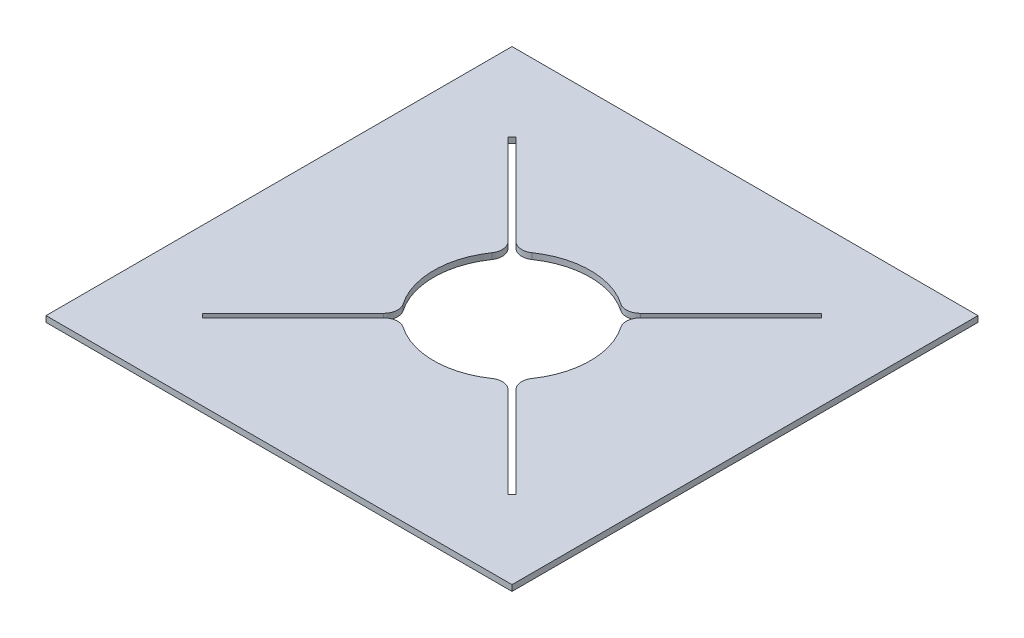
ISO-10303-21;
HEADER;
FILE_DESCRIPTION(('STEP AP214'),'2;1');
FILE_NAME('part.step','',(''),(''),'','','');
FILE_SCHEMA(('AUTOMOTIVE_DESIGN { 1 0 10303 214 1 1 1 1 }'));
ENDSEC;
DATA;
#1=APPLICATION_CONTEXT('core data for automotive mechanical design processes');
#2=APPLICATION_PROTOCOL_DEFINITION('international standard','automotive_design',2000,#1);
#3=PRODUCT_CONTEXT('',#1,'mechanical');
#4=PRODUCT('Part','Part','',(#3));
#5=PRODUCT_RELATED_PRODUCT_CATEGORY('part','',(#4));
#6=PRODUCT_DEFINITION_FORMATION('','',#4);
#7=PRODUCT_DEFINITION_CONTEXT('part definition',#1,'design');
#8=PRODUCT_DEFINITION('design','',#6,#7);
#9=PRODUCT_DEFINITION_SHAPE('','',#8);
#10=(LENGTH_UNIT() NAMED_UNIT(*) SI_UNIT(.MILLI.,.METRE.));
#11=(NAMED_UNIT(*) PLANE_ANGLE_UNIT() SI_UNIT($,.RADIAN.));
#12=(NAMED_UNIT(*) SI_UNIT($,.STERADIAN.) SOLID_ANGLE_UNIT());
#13=UNCERTAINTY_MEASURE_WITH_UNIT(LENGTH_MEASURE(1.E-05),#10,'distance_accuracy_value','');
#14=(GEOMETRIC_REPRESENTATION_CONTEXT(3) GLOBAL_UNCERTAINTY_ASSIGNED_CONTEXT((#13)) GLOBAL_UNIT_ASSIGNED_CONTEXT((#10,
#11,#12)) REPRESENTATION_CONTEXT('',''));
#15=CARTESIAN_POINT('',(0.,0.,0.));
#16=DIRECTION('',(0.,0.,1.));
#17=DIRECTION('',(1.,0.,0.));
#18=AXIS2_PLACEMENT_3D('',#15,#16,#17);
#19=CARTESIAN_POINT('',(0.,6.35,0.));
#20=DIRECTION('',(0.,1.,0.));
#21=DIRECTION('',(0.,0.,1.));
#22=AXIS2_PLACEMENT_3D('',#19,#20,#21);
#23=PLANE('',#22);
#24=DIRECTION('',(0.,0.,1.));
#25=VECTOR('',#24,1.);
#26=CARTESIAN_POINT('',(-201.962395087908,6.35,-164.543723548515));
#27=LINE('',#26,#25);
#28=CARTESIAN_POINT('',(-201.962395087908,6.35,-164.543723548515));
#29=VERTEX_POINT('',#28);
#30=CARTESIAN_POINT('',(-201.962395087908,6.35,335.456276451485));
#31=VERTEX_POINT('',#30);
#32=EDGE_CURVE('E331',#29,#31,#27,.T.);
#33=ORIENTED_EDGE('',*,*,#32,.T.);
#34=DIRECTION('',(1.,0.,0.));
#35=VECTOR('',#34,1.);
#36=CARTESIAN_POINT('',(-201.962395087908,6.35,335.456276451485));
#37=LINE('',#36,#35);
#38=CARTESIAN_POINT('',(298.037604912092,6.35,335.456276451485));
#39=VERTEX_POINT('',#38);
#40=EDGE_CURVE('E334',#31,#39,#37,.T.);
#41=ORIENTED_EDGE('',*,*,#40,.T.);
#42=DIRECTION('',(0.,0.,-1.));
#43=VECTOR('',#42,1.);
#44=CARTESIAN_POINT('',(298.037604912092,6.35,-164.543723548515));
#45=LINE('',#44,#43);
#46=CARTESIAN_POINT('',(298.037604912092,6.35,-164.543723548515));
#47=VERTEX_POINT('',#46);
#48=EDGE_CURVE('E337',#39,#47,#45,.T.);
#49=ORIENTED_EDGE('',*,*,#48,.T.);
#50=DIRECTION('',(-1.,0.,0.));
#51=VECTOR('',#50,1.);
#52=CARTESIAN_POINT('',(-201.962395087908,6.35,-164.543723548515));
#53=LINE('',#52,#51);
#54=EDGE_CURVE('E339',#47,#29,#53,.T.);
#55=ORIENTED_EDGE('',*,*,#54,.T.);
#56=EDGE_LOOP('',(#33,#41,#49,#55));
#57=FACE_BOUND('',#56,.T.);
#58=CARTESIAN_POINT('',(48.0376049120916,6.35,85.4562764514846));
#59=DIRECTION('',(0.,1.,0.));
#60=DIRECTION('',(0.,0.,1.));
#61=AXIS2_PLACEMENT_3D('',#58,#59,#60);
#62=CIRCLE('',#61,84.);
#63=CARTESIAN_POINT('',(95.6451066823906,6.35,16.2498766376597));
#64=VERTEX_POINT('',#63);
#65=CARTESIAN_POINT('',(0.430103141786861,6.35,16.2498766376637));
#66=VERTEX_POINT('',#65);
#67=EDGE_CURVE('E325',#64,#66,#62,.T.);
#68=ORIENTED_EDGE('',*,*,#67,.F.);
#69=CARTESIAN_POINT('',(104.14644628423,6.35,3.89159095661956));
#70=DIRECTION('',(0.,1.,0.));
#71=DIRECTION('',(0.,0.,1.));
#72=AXIS2_PLACEMENT_3D('',#69,#70,#71);
#73=CIRCLE('',#72,15.);
#74=CARTESIAN_POINT('',(114.753048002028,6.35,14.4981926744178));
#75=VERTEX_POINT('',#74);
#76=EDGE_CURVE('E379',#64,#75,#73,.T.);
#77=ORIENTED_EDGE('',*,*,#76,.T.);
#78=DIRECTION('',(-0.707106781186548,0.,0.707106781186546));
#79=VECTOR('',#78,1.);
#80=CARTESIAN_POINT('',(212.086378147371,6.35,-82.8351374709255));
#81=LINE('',#80,#79);
#82=CARTESIAN_POINT('',(212.086378147371,6.35,-82.8351374709255));
#83=VERTEX_POINT('',#82);
#84=EDGE_CURVE('E304',#83,#75,#81,.T.);
#85=ORIENTED_EDGE('',*,*,#84,.F.);
#86=DIRECTION('',(0.707106781186551,0.,0.707106781186544));
#87=VECTOR('',#86,1.);
#88=CARTESIAN_POINT('',(212.086378147371,6.35,-82.8351374709255));
#89=LINE('',#88,#87);
#90=CARTESIAN_POINT('',(216.329018834491,6.35,-78.5924967838062));
#91=VERTEX_POINT('',#90);
#92=EDGE_CURVE('E242',#83,#91,#89,.T.);
#93=ORIENTED_EDGE('',*,*,#92,.T.);
#94=DIRECTION('',(-0.707106781186549,0.,0.707106781186546));
#95=VECTOR('',#94,1.);
#96=CARTESIAN_POINT('',(216.329018834491,6.35,-78.5924967838062));
#97=LINE('',#96,#95);
#98=CARTESIAN_POINT('',(118.995688689149,6.35,18.740833361535));
#99=VERTEX_POINT('',#98);
#100=EDGE_CURVE('E312',#91,#99,#97,.T.);
#101=ORIENTED_EDGE('',*,*,#100,.T.);
#102=CARTESIAN_POINT('',(129.602290406947,6.35,29.3474350793332));
#103=DIRECTION('',(0.,1.,0.));
#104=DIRECTION('',(0.,0.,1.));
#105=AXIS2_PLACEMENT_3D('',#102,#103,#104);
#106=CIRCLE('',#105,15.);
#107=CARTESIAN_POINT('',(117.244004725909,6.35,37.8487746811743));
#108=VERTEX_POINT('',#107);
#109=EDGE_CURVE('E377',#99,#108,#106,.T.);
#110=ORIENTED_EDGE('',*,*,#109,.T.);
#111=CARTESIAN_POINT('',(117.244004725921,6.35,133.063778221777));
#112=VERTEX_POINT('',#111);
#113=EDGE_CURVE('E321',#112,#108,#62,.T.);
#114=ORIENTED_EDGE('',*,*,#113,.F.);
#115=CARTESIAN_POINT('',(129.602290406962,6.35,141.565117823616));
#116=DIRECTION('',(0.,1.,0.));
#117=DIRECTION('',(0.,0.,1.));
#118=AXIS2_PLACEMENT_3D('',#115,#116,#117);
#119=CIRCLE('',#118,15.);
#120=CARTESIAN_POINT('',(118.995688689163,6.35,152.171719541414));
#121=VERTEX_POINT('',#120);
#122=EDGE_CURVE('E375',#112,#121,#119,.T.);
#123=ORIENTED_EDGE('',*,*,#122,.T.);
#124=DIRECTION('',(-0.707106781186544,0.,-0.707106781186551));
#125=VECTOR('',#124,1.);
#126=CARTESIAN_POINT('',(216.329018834502,6.35,249.505049686753));
#127=LINE('',#126,#125);
#128=CARTESIAN_POINT('',(216.329018834502,6.35,249.505049686753));
#129=VERTEX_POINT('',#128);
#130=EDGE_CURVE('E286',#129,#121,#127,.T.);
#131=ORIENTED_EDGE('',*,*,#130,.F.);
#132=DIRECTION('',(-0.707106781186552,0.,0.707106781186543));
#133=VECTOR('',#132,1.);
#134=CARTESIAN_POINT('',(216.329018834502,6.35,249.505049686753));
#135=LINE('',#134,#133);
#136=CARTESIAN_POINT('',(212.086378147382,6.35,253.747690373872));
#137=VERTEX_POINT('',#136);
#138=EDGE_CURVE('E263',#129,#137,#135,.T.);
#139=ORIENTED_EDGE('',*,*,#138,.T.);
#140=DIRECTION('',(-0.707106781186544,0.,-0.707106781186551));
#141=VECTOR('',#140,1.);
#142=CARTESIAN_POINT('',(212.086378147382,6.35,253.747690373872));
#143=LINE('',#142,#141);
#144=CARTESIAN_POINT('',(114.753048002048,6.35,156.414360228537));
#145=VERTEX_POINT('',#144);
#146=EDGE_CURVE('E289',#137,#145,#143,.T.);
#147=ORIENTED_EDGE('',*,*,#146,.T.);
#148=CARTESIAN_POINT('',(104.14644628425,6.35,167.020961946336));
#149=DIRECTION('',(0.,1.,0.));
#150=DIRECTION('',(0.,0.,1.));
#151=AXIS2_PLACEMENT_3D('',#148,#149,#150);
#152=CIRCLE('',#151,15.);
#153=CARTESIAN_POINT('',(95.6451066824079,6.35,154.662676265298));
#154=VERTEX_POINT('',#153);
#155=EDGE_CURVE('E373',#145,#154,#152,.T.);
#156=ORIENTED_EDGE('',*,*,#155,.T.);
#157=CARTESIAN_POINT('',(0.430103141792704,6.35,154.662676265309));
#158=VERTEX_POINT('',#157);
#159=EDGE_CURVE('E330',#158,#154,#62,.T.);
#160=ORIENTED_EDGE('',*,*,#159,.F.);
#161=CARTESIAN_POINT('',(-8.07123646004639,6.35,167.02096194635));
#162=DIRECTION('',(0.,1.,0.));
#163=DIRECTION('',(0.,0.,1.));
#164=AXIS2_PLACEMENT_3D('',#161,#162,#163);
#165=CIRCLE('',#164,15.);
#166=CARTESIAN_POINT('',(-18.6778381778445,6.35,156.414360228551));
#167=VERTEX_POINT('',#166);
#168=EDGE_CURVE('E371',#158,#167,#165,.T.);
#169=ORIENTED_EDGE('',*,*,#168,.T.);
#170=DIRECTION('',(0.707106781186553,0.,-0.707106781186542));
#171=VECTOR('',#170,1.);
#172=CARTESIAN_POINT('',(-116.011168323177,6.35,253.747690373882));
#173=LINE('',#172,#171);
#174=CARTESIAN_POINT('',(-116.011168323177,6.35,253.747690373882));
#175=VERTEX_POINT('',#174);
#176=EDGE_CURVE('E271',#175,#167,#173,.T.);
#177=ORIENTED_EDGE('',*,*,#176,.F.);
#178=DIRECTION('',(-0.707106781186542,0.,-0.707106781186553));
#179=VECTOR('',#178,1.);
#180=CARTESIAN_POINT('',(-116.011168323177,6.35,253.747690373882));
#181=LINE('',#180,#179);
#182=CARTESIAN_POINT('',(-120.253809010296,6.35,249.505049686763));
#183=VERTEX_POINT('',#182);
#184=EDGE_CURVE('E264',#175,#183,#181,.T.);
#185=ORIENTED_EDGE('',*,*,#184,.T.);
#186=DIRECTION('',(0.707106781186554,0.,-0.707106781186541));
#187=VECTOR('',#186,1.);
#188=CARTESIAN_POINT('',(-120.253809010296,6.35,249.505049686763));
#189=LINE('',#188,#187);
#190=CARTESIAN_POINT('',(-22.9204788649661,6.35,152.171719541434));
#191=VERTEX_POINT('',#190);
#192=EDGE_CURVE('E267',#183,#191,#189,.T.);
#193=ORIENTED_EDGE('',*,*,#192,.T.);
#194=CARTESIAN_POINT('',(-33.5270805827642,6.35,141.565117823636));
#195=DIRECTION('',(0.,1.,0.));
#196=DIRECTION('',(0.,0.,1.));
#197=AXIS2_PLACEMENT_3D('',#194,#195,#196);
#198=CIRCLE('',#197,15.);
#199=CARTESIAN_POINT('',(-21.1687949017254,6.35,133.063778221795));
#200=VERTEX_POINT('',#199);
#201=EDGE_CURVE('E369',#191,#200,#198,.T.);
#202=ORIENTED_EDGE('',*,*,#201,.T.);
#203=CARTESIAN_POINT('',(-21.1687949017294,6.35,37.8487746811801));
#204=VERTEX_POINT('',#203);
#205=EDGE_CURVE('E327',#204,#200,#62,.T.);
#206=ORIENTED_EDGE('',*,*,#205,.F.);
#207=CARTESIAN_POINT('',(-33.5270805827689,6.35,29.34743507934));
#208=DIRECTION('',(0.,1.,0.));
#209=DIRECTION('',(0.,0.,1.));
#210=AXIS2_PLACEMENT_3D('',#207,#208,#209);
#211=CIRCLE('',#210,15.);
#212=CARTESIAN_POINT('',(-22.9204788649707,6.35,18.7408333615418));
#213=VERTEX_POINT('',#212);
#214=EDGE_CURVE('E247',#204,#213,#211,.T.);
#215=ORIENTED_EDGE('',*,*,#214,.T.);
#216=DIRECTION('',(0.707106781186549,0.,0.707106781186546));
#217=VECTOR('',#216,1.);
#218=CARTESIAN_POINT('',(-120.253809010307,6.35,-78.5924967837941));
#219=LINE('',#218,#217);
#220=CARTESIAN_POINT('',(-120.253809010307,6.35,-78.5924967837941));
#221=VERTEX_POINT('',#220);
#222=EDGE_CURVE('E227',#221,#213,#219,.T.);
#223=ORIENTED_EDGE('',*,*,#222,.F.);
#224=DIRECTION('',(0.707106781186543,0.,-0.707106781186552));
#225=VECTOR('',#224,1.);
#226=CARTESIAN_POINT('',(-120.253809010307,6.35,-78.5924967837941));
#227=LINE('',#226,#225);
#228=CARTESIAN_POINT('',(-116.011168323188,6.35,-82.8351374709135));
#229=VERTEX_POINT('',#228);
#230=EDGE_CURVE('E237',#221,#229,#227,.T.);
#231=ORIENTED_EDGE('',*,*,#230,.T.);
#232=DIRECTION('',(0.707106781186549,0.,0.707106781186546));
#233=VECTOR('',#232,1.);
#234=CARTESIAN_POINT('',(-116.011168323188,6.35,-82.8351374709135));
#235=LINE('',#234,#233);
#236=CARTESIAN_POINT('',(-18.6778381778515,6.35,14.4981926744224));
#237=VERTEX_POINT('',#236);
#238=EDGE_CURVE('E243',#229,#237,#235,.T.);
#239=ORIENTED_EDGE('',*,*,#238,.T.);
#240=CARTESIAN_POINT('',(-8.07123646005327,6.35,3.89159095662425));
#241=DIRECTION('',(0.,1.,0.));
#242=DIRECTION('',(0.,0.,1.));
#243=AXIS2_PLACEMENT_3D('',#240,#241,#242);
#244=CIRCLE('',#243,15.);
#245=EDGE_CURVE('E366',#237,#66,#244,.T.);
#246=ORIENTED_EDGE('',*,*,#245,.T.);
#247=EDGE_LOOP('',(#68,#77,#85,#93,#101,#110,#114,#123,#131,#139,#147,#156,#160,#169,#177,#185,
#193,#202,#206,#215,#223,#231,#239,#246));
#248=FACE_BOUND('',#247,.T.);
#249=ADVANCED_FACE('F35',(#57,#248),#23,.T.);
#250=CARTESIAN_POINT('',(0.,0.,0.));
#251=DIRECTION('',(0.,1.,0.));
#252=DIRECTION('',(0.,0.,1.));
#253=AXIS2_PLACEMENT_3D('',#250,#251,#252);
#254=PLANE('',#253);
#255=DIRECTION('',(0.,0.,1.));
#256=VECTOR('',#255,1.);
#257=CARTESIAN_POINT('',(-201.962395087908,0.,-164.543723548515));
#258=LINE('',#257,#256);
#259=CARTESIAN_POINT('',(-201.962395087908,0.,-164.543723548515));
#260=VERTEX_POINT('',#259);
#261=CARTESIAN_POINT('',(-201.962395087908,0.,335.456276451485));
#262=VERTEX_POINT('',#261);
#263=EDGE_CURVE('E342',#260,#262,#258,.T.);
#264=ORIENTED_EDGE('',*,*,#263,.F.);
#265=DIRECTION('',(-1.,0.,0.));
#266=VECTOR('',#265,1.);
#267=CARTESIAN_POINT('',(-201.962395087908,0.,-164.543723548515));
#268=LINE('',#267,#266);
#269=CARTESIAN_POINT('',(298.037604912092,0.,-164.543723548515));
#270=VERTEX_POINT('',#269);
#271=EDGE_CURVE('E335',#270,#260,#268,.T.);
#272=ORIENTED_EDGE('',*,*,#271,.F.);
#273=DIRECTION('',(0.,0.,-1.));
#274=VECTOR('',#273,1.);
#275=CARTESIAN_POINT('',(298.037604912092,0.,-164.543723548515));
#276=LINE('',#275,#274);
#277=CARTESIAN_POINT('',(298.037604912092,0.,335.456276451485));
#278=VERTEX_POINT('',#277);
#279=EDGE_CURVE('E347',#278,#270,#276,.T.);
#280=ORIENTED_EDGE('',*,*,#279,.F.);
#281=DIRECTION('',(1.,0.,0.));
#282=VECTOR('',#281,1.);
#283=CARTESIAN_POINT('',(-201.962395087908,0.,335.456276451485));
#284=LINE('',#283,#282);
#285=EDGE_CURVE('E345',#262,#278,#284,.T.);
#286=ORIENTED_EDGE('',*,*,#285,.F.);
#287=EDGE_LOOP('',(#264,#272,#280,#286));
#288=FACE_BOUND('',#287,.T.);
#289=DIRECTION('',(-0.707106781186548,0.,0.707106781186546));
#290=VECTOR('',#289,1.);
#291=CARTESIAN_POINT('',(212.086378147371,0.,-82.8351374709255));
#292=LINE('',#291,#290);
#293=CARTESIAN_POINT('',(212.086378147371,0.,-82.8351374709255));
#294=VERTEX_POINT('',#293);
#295=CARTESIAN_POINT('',(114.753048002028,0.,14.4981926744178));
#296=VERTEX_POINT('',#295);
#297=EDGE_CURVE('E306',#294,#296,#292,.T.);
#298=ORIENTED_EDGE('',*,*,#297,.T.);
#299=CARTESIAN_POINT('',(104.14644628423,0.,3.89159095661956));
#300=DIRECTION('',(0.,1.,0.));
#301=DIRECTION('',(0.,0.,1.));
#302=AXIS2_PLACEMENT_3D('',#299,#300,#301);
#303=CIRCLE('',#302,15.);
#304=CARTESIAN_POINT('',(95.6451066823906,0.,16.2498766376597));
#305=VERTEX_POINT('',#304);
#306=EDGE_CURVE('E396',#296,#305,#303,.F.);
#307=ORIENTED_EDGE('',*,*,#306,.T.);
#308=CARTESIAN_POINT('',(48.0376049120916,0.,85.4562764514846));
#309=DIRECTION('',(0.,1.,0.));
#310=DIRECTION('',(0.,0.,1.));
#311=AXIS2_PLACEMENT_3D('',#308,#309,#310);
#312=CIRCLE('',#311,84.);
#313=CARTESIAN_POINT('',(0.430103141786861,0.,16.2498766376637));
#314=VERTEX_POINT('',#313);
#315=EDGE_CURVE('E326',#305,#314,#312,.T.);
#316=ORIENTED_EDGE('',*,*,#315,.T.);
#317=CARTESIAN_POINT('',(-8.07123646005327,0.,3.89159095662425));
#318=DIRECTION('',(0.,1.,0.));
#319=DIRECTION('',(0.,0.,1.));
#320=AXIS2_PLACEMENT_3D('',#317,#318,#319);
#321=CIRCLE('',#320,15.);
#322=CARTESIAN_POINT('',(-18.6778381778515,0.,14.4981926744224));
#323=VERTEX_POINT('',#322);
#324=EDGE_CURVE('E383',#314,#323,#321,.F.);
#325=ORIENTED_EDGE('',*,*,#324,.T.);
#326=DIRECTION('',(0.707106781186549,0.,0.707106781186546));
#327=VECTOR('',#326,1.);
#328=CARTESIAN_POINT('',(-116.011168323188,0.,-82.8351374709135));
#329=LINE('',#328,#327);
#330=CARTESIAN_POINT('',(-116.011168323188,0.,-82.8351374709135));
#331=VERTEX_POINT('',#330);
#332=EDGE_CURVE('E251',#331,#323,#329,.T.);
#333=ORIENTED_EDGE('',*,*,#332,.F.);
#334=DIRECTION('',(0.707106781186543,0.,-0.707106781186552));
#335=VECTOR('',#334,1.);
#336=CARTESIAN_POINT('',(-120.253809010307,0.,-78.5924967837941));
#337=LINE('',#336,#335);
#338=CARTESIAN_POINT('',(-120.253809010307,0.,-78.5924967837941));
#339=VERTEX_POINT('',#338);
#340=EDGE_CURVE('E248',#339,#331,#337,.T.);
#341=ORIENTED_EDGE('',*,*,#340,.F.);
#342=DIRECTION('',(0.707106781186549,0.,0.707106781186546));
#343=VECTOR('',#342,1.);
#344=CARTESIAN_POINT('',(-120.253809010307,0.,-78.5924967837941));
#345=LINE('',#344,#343);
#346=CARTESIAN_POINT('',(-22.9204788649707,0.,18.7408333615418));
#347=VERTEX_POINT('',#346);
#348=EDGE_CURVE('E230',#339,#347,#345,.T.);
#349=ORIENTED_EDGE('',*,*,#348,.T.);
#350=CARTESIAN_POINT('',(-33.5270805827689,0.,29.34743507934));
#351=DIRECTION('',(0.,1.,0.));
#352=DIRECTION('',(0.,0.,1.));
#353=AXIS2_PLACEMENT_3D('',#350,#351,#352);
#354=CIRCLE('',#353,15.);
#355=CARTESIAN_POINT('',(-21.1687949017294,0.,37.8487746811801));
#356=VERTEX_POINT('',#355);
#357=EDGE_CURVE('E385',#347,#356,#354,.F.);
#358=ORIENTED_EDGE('',*,*,#357,.T.);
#359=CARTESIAN_POINT('',(-21.1687949017254,0.,133.063778221795));
#360=VERTEX_POINT('',#359);
#361=EDGE_CURVE('E435',#356,#360,#312,.T.);
#362=ORIENTED_EDGE('',*,*,#361,.T.);
#363=CARTESIAN_POINT('',(-33.5270805827642,0.,141.565117823636));
#364=DIRECTION('',(0.,1.,0.));
#365=DIRECTION('',(0.,0.,1.));
#366=AXIS2_PLACEMENT_3D('',#363,#364,#365);
#367=CIRCLE('',#366,15.);
#368=CARTESIAN_POINT('',(-22.9204788649661,0.,152.171719541434));
#369=VERTEX_POINT('',#368);
#370=EDGE_CURVE('E387',#360,#369,#367,.F.);
#371=ORIENTED_EDGE('',*,*,#370,.T.);
#372=DIRECTION('',(0.707106781186554,0.,-0.707106781186541));
#373=VECTOR('',#372,1.);
#374=CARTESIAN_POINT('',(-120.253809010296,0.,249.505049686763));
#375=LINE('',#374,#373);
#376=CARTESIAN_POINT('',(-120.253809010296,0.,249.505049686763));
#377=VERTEX_POINT('',#376);
#378=EDGE_CURVE('E275',#377,#369,#375,.T.);
#379=ORIENTED_EDGE('',*,*,#378,.F.);
#380=DIRECTION('',(-0.707106781186542,0.,-0.707106781186553));
#381=VECTOR('',#380,1.);
#382=CARTESIAN_POINT('',(-116.011168323177,0.,253.747690373882));
#383=LINE('',#382,#381);
#384=CARTESIAN_POINT('',(-116.011168323177,0.,253.747690373882));
#385=VERTEX_POINT('',#384);
#386=EDGE_CURVE('E260',#385,#377,#383,.T.);
#387=ORIENTED_EDGE('',*,*,#386,.F.);
#388=DIRECTION('',(0.707106781186553,0.,-0.707106781186542));
#389=VECTOR('',#388,1.);
#390=CARTESIAN_POINT('',(-116.011168323177,0.,253.747690373882));
#391=LINE('',#390,#389);
#392=CARTESIAN_POINT('',(-18.6778381778445,0.,156.414360228551));
#393=VERTEX_POINT('',#392);
#394=EDGE_CURVE('E268',#385,#393,#391,.T.);
#395=ORIENTED_EDGE('',*,*,#394,.T.);
#396=CARTESIAN_POINT('',(-8.07123646004639,0.,167.02096194635));
#397=DIRECTION('',(0.,1.,0.));
#398=DIRECTION('',(0.,0.,1.));
#399=AXIS2_PLACEMENT_3D('',#396,#397,#398);
#400=CIRCLE('',#399,15.);
#401=CARTESIAN_POINT('',(0.430103141792704,0.,154.662676265309));
#402=VERTEX_POINT('',#401);
#403=EDGE_CURVE('E389',#393,#402,#400,.F.);
#404=ORIENTED_EDGE('',*,*,#403,.T.);
#405=CARTESIAN_POINT('',(95.6451066824079,0.,154.662676265298));
#406=VERTEX_POINT('',#405);
#407=EDGE_CURVE('E324',#402,#406,#312,.T.);
#408=ORIENTED_EDGE('',*,*,#407,.T.);
#409=CARTESIAN_POINT('',(104.14644628425,0.,167.020961946336));
#410=DIRECTION('',(0.,1.,0.));
#411=DIRECTION('',(0.,0.,1.));
#412=AXIS2_PLACEMENT_3D('',#409,#410,#411);
#413=CIRCLE('',#412,15.);
#414=CARTESIAN_POINT('',(114.753048002048,0.,156.414360228537));
#415=VERTEX_POINT('',#414);
#416=EDGE_CURVE('E391',#406,#415,#413,.F.);
#417=ORIENTED_EDGE('',*,*,#416,.T.);
#418=DIRECTION('',(-0.707106781186544,0.,-0.707106781186551));
#419=VECTOR('',#418,1.);
#420=CARTESIAN_POINT('',(212.086378147382,0.,253.747690373872));
#421=LINE('',#420,#419);
#422=CARTESIAN_POINT('',(212.086378147382,0.,253.747690373872));
#423=VERTEX_POINT('',#422);
#424=EDGE_CURVE('E297',#423,#415,#421,.T.);
#425=ORIENTED_EDGE('',*,*,#424,.F.);
#426=DIRECTION('',(-0.707106781186552,0.,0.707106781186543));
#427=VECTOR('',#426,1.);
#428=CARTESIAN_POINT('',(216.329018834502,0.,249.505049686753));
#429=LINE('',#428,#427);
#430=CARTESIAN_POINT('',(216.329018834502,0.,249.505049686753));
#431=VERTEX_POINT('',#430);
#432=EDGE_CURVE('E290',#431,#423,#429,.T.);
#433=ORIENTED_EDGE('',*,*,#432,.F.);
#434=DIRECTION('',(-0.707106781186544,0.,-0.707106781186551));
#435=VECTOR('',#434,1.);
#436=CARTESIAN_POINT('',(216.329018834502,0.,249.505049686753));
#437=LINE('',#436,#435);
#438=CARTESIAN_POINT('',(118.995688689163,0.,152.171719541414));
#439=VERTEX_POINT('',#438);
#440=EDGE_CURVE('E285',#431,#439,#437,.T.);
#441=ORIENTED_EDGE('',*,*,#440,.T.);
#442=CARTESIAN_POINT('',(129.602290406962,0.,141.565117823616));
#443=DIRECTION('',(0.,1.,0.));
#444=DIRECTION('',(0.,0.,1.));
#445=AXIS2_PLACEMENT_3D('',#442,#443,#444);
#446=CIRCLE('',#445,15.);
#447=CARTESIAN_POINT('',(117.244004725921,0.,133.063778221777));
#448=VERTEX_POINT('',#447);
#449=EDGE_CURVE('E393',#439,#448,#446,.F.);
#450=ORIENTED_EDGE('',*,*,#449,.T.);
#451=CARTESIAN_POINT('',(117.244004725909,0.,37.8487746811743));
#452=VERTEX_POINT('',#451);
#453=EDGE_CURVE('E322',#448,#452,#312,.T.);
#454=ORIENTED_EDGE('',*,*,#453,.T.);
#455=CARTESIAN_POINT('',(129.602290406947,0.,29.3474350793332));
#456=DIRECTION('',(0.,1.,0.));
#457=DIRECTION('',(0.,0.,1.));
#458=AXIS2_PLACEMENT_3D('',#455,#456,#457);
#459=CIRCLE('',#458,15.);
#460=CARTESIAN_POINT('',(118.995688689149,0.,18.740833361535));
#461=VERTEX_POINT('',#460);
#462=EDGE_CURVE('E50',#452,#461,#459,.F.);
#463=ORIENTED_EDGE('',*,*,#462,.T.);
#464=DIRECTION('',(-0.707106781186549,0.,0.707106781186546));
#465=VECTOR('',#464,1.);
#466=CARTESIAN_POINT('',(216.329018834491,0.,-78.5924967838062));
#467=LINE('',#466,#465);
#468=CARTESIAN_POINT('',(216.329018834491,0.,-78.5924967838062));
#469=VERTEX_POINT('',#468);
#470=EDGE_CURVE('E303',#469,#461,#467,.T.);
#471=ORIENTED_EDGE('',*,*,#470,.F.);
#472=DIRECTION('',(0.707106781186551,0.,0.707106781186544));
#473=VECTOR('',#472,1.);
#474=CARTESIAN_POINT('',(212.086378147371,0.,-82.8351374709255));
#475=LINE('',#474,#473);
#476=EDGE_CURVE('E301',#294,#469,#475,.T.);
#477=ORIENTED_EDGE('',*,*,#476,.F.);
#478=EDGE_LOOP('',(#298,#307,#316,#325,#333,#341,#349,#358,#362,#371,#379,#387,#395,#404,#408,
#417,#425,#433,#441,#450,#454,#463,#471,#477));
#479=FACE_BOUND('',#478,.T.);
#480=ADVANCED_FACE('F426',(#288,#479),#254,.F.);
#481=CARTESIAN_POINT('',(48.0376049120916,0.,85.4562764514846));
#482=DIRECTION('',(0.,1.,0.));
#483=DIRECTION('',(0.,0.,1.));
#484=AXIS2_PLACEMENT_3D('',#481,#482,#483);
#485=CYLINDRICAL_SURFACE('',#484,84.);
#486=ORIENTED_EDGE('',*,*,#315,.F.);
#487=DIRECTION('',(0.,1.,0.));
#488=VECTOR('',#487,1.);
#489=CARTESIAN_POINT('',(95.6451066823906,0.,16.2498766376597));
#490=LINE('',#489,#488);
#491=EDGE_CURVE('E363',#305,#64,#490,.T.);
#492=ORIENTED_EDGE('',*,*,#491,.T.);
#493=ORIENTED_EDGE('',*,*,#67,.T.);
#494=DIRECTION('',(0.,1.,0.));
#495=VECTOR('',#494,1.);
#496=CARTESIAN_POINT('',(0.430103141786861,0.,16.2498766376637));
#497=LINE('',#496,#495);
#498=EDGE_CURVE('E361',#66,#314,#497,.F.);
#499=ORIENTED_EDGE('',*,*,#498,.T.);
#500=EDGE_LOOP('',(#486,#492,#493,#499));
#501=FACE_BOUND('',#500,.T.);
#502=ADVANCED_FACE('F481',(#501),#485,.F.);
#503=ORIENTED_EDGE('',*,*,#205,.T.);
#504=DIRECTION('',(0.,1.,0.));
#505=VECTOR('',#504,1.);
#506=CARTESIAN_POINT('',(-21.1687949017255,0.,133.063778221795));
#507=LINE('',#506,#505);
#508=EDGE_CURVE('E423',#200,#360,#507,.F.);
#509=ORIENTED_EDGE('',*,*,#508,.T.);
#510=ORIENTED_EDGE('',*,*,#361,.F.);
#511=DIRECTION('',(0.,1.,0.));
#512=VECTOR('',#511,1.);
#513=CARTESIAN_POINT('',(-21.1687949017294,0.,37.8487746811801));
#514=LINE('',#513,#512);
#515=EDGE_CURVE('E420',#356,#204,#514,.T.);
#516=ORIENTED_EDGE('',*,*,#515,.T.);
#517=EDGE_LOOP('',(#503,#509,#510,#516));
#518=FACE_BOUND('',#517,.T.);
#519=ADVANCED_FACE('F433',(#518),#485,.F.);
#520=ORIENTED_EDGE('',*,*,#159,.T.);
#521=DIRECTION('',(0.,1.,0.));
#522=VECTOR('',#521,1.);
#523=CARTESIAN_POINT('',(95.6451066824079,0.,154.662676265298));
#524=LINE('',#523,#522);
#525=EDGE_CURVE('E413',#154,#406,#524,.F.);
#526=ORIENTED_EDGE('',*,*,#525,.T.);
#527=ORIENTED_EDGE('',*,*,#407,.F.);
#528=DIRECTION('',(0.,1.,0.));
#529=VECTOR('',#528,1.);
#530=CARTESIAN_POINT('',(0.430103141792704,0.,154.662676265309));
#531=LINE('',#530,#529);
#532=EDGE_CURVE('E410',#402,#158,#531,.T.);
#533=ORIENTED_EDGE('',*,*,#532,.T.);
#534=EDGE_LOOP('',(#520,#526,#527,#533));
#535=FACE_BOUND('',#534,.T.);
#536=ADVANCED_FACE('F672',(#535),#485,.F.);
#537=ORIENTED_EDGE('',*,*,#113,.T.);
#538=DIRECTION('',(0.,1.,0.));
#539=VECTOR('',#538,1.);
#540=CARTESIAN_POINT('',(117.244004725909,0.,37.8487746811743));
#541=LINE('',#540,#539);
#542=EDGE_CURVE('E58',#108,#452,#541,.F.);
#543=ORIENTED_EDGE('',*,*,#542,.T.);
#544=ORIENTED_EDGE('',*,*,#453,.F.);
#545=DIRECTION('',(0.,1.,0.));
#546=VECTOR('',#545,1.);
#547=CARTESIAN_POINT('',(117.244004725921,0.,133.063778221777));
#548=LINE('',#547,#546);
#549=EDGE_CURVE('E401',#448,#112,#548,.T.);
#550=ORIENTED_EDGE('',*,*,#549,.T.);
#551=EDGE_LOOP('',(#537,#543,#544,#550));
#552=FACE_BOUND('',#551,.T.);
#553=ADVANCED_FACE('F476',(#552),#485,.F.);
#554=CARTESIAN_POINT('',(-201.962395087908,6.35,-164.543723548515));
#555=DIRECTION('',(1.,0.,0.));
#556=DIRECTION('',(0.,0.,-1.));
#557=AXIS2_PLACEMENT_3D('',#554,#555,#556);
#558=PLANE('',#557);
#559=ORIENTED_EDGE('',*,*,#263,.T.);
#560=DIRECTION('',(0.,-1.,0.));
#561=VECTOR('',#560,1.);
#562=CARTESIAN_POINT('',(-201.962395087908,6.35,335.456276451485));
#563=LINE('',#562,#561);
#564=EDGE_CURVE('E358',#31,#262,#563,.T.);
#565=ORIENTED_EDGE('',*,*,#564,.F.);
#566=ORIENTED_EDGE('',*,*,#32,.F.);
#567=DIRECTION('',(0.,-1.,0.));
#568=VECTOR('',#567,1.);
#569=CARTESIAN_POINT('',(-201.962395087908,6.35,-164.543723548515));
#570=LINE('',#569,#568);
#571=EDGE_CURVE('E341',#29,#260,#570,.T.);
#572=ORIENTED_EDGE('',*,*,#571,.T.);
#573=EDGE_LOOP('',(#559,#565,#566,#572));
#574=FACE_BOUND('',#573,.T.);
#575=ADVANCED_FACE('F522',(#574),#558,.F.);
#576=CARTESIAN_POINT('',(-201.962395087908,6.35,335.456276451485));
#577=DIRECTION('',(0.,0.,-1.));
#578=DIRECTION('',(-1.,0.,0.));
#579=AXIS2_PLACEMENT_3D('',#576,#577,#578);
#580=PLANE('',#579);
#581=ORIENTED_EDGE('',*,*,#285,.T.);
#582=DIRECTION('',(0.,-1.,0.));
#583=VECTOR('',#582,1.);
#584=CARTESIAN_POINT('',(298.037604912092,6.35,335.456276451485));
#585=LINE('',#584,#583);
#586=EDGE_CURVE('E355',#39,#278,#585,.T.);
#587=ORIENTED_EDGE('',*,*,#586,.F.);
#588=ORIENTED_EDGE('',*,*,#40,.F.);
#589=ORIENTED_EDGE('',*,*,#564,.T.);
#590=EDGE_LOOP('',(#581,#587,#588,#589));
#591=FACE_BOUND('',#590,.T.);
#592=ADVANCED_FACE('F518',(#591),#580,.F.);
#593=CARTESIAN_POINT('',(298.037604912092,6.35,-164.543723548515));
#594=DIRECTION('',(-1.,0.,0.));
#595=DIRECTION('',(0.,0.,1.));
#596=AXIS2_PLACEMENT_3D('',#593,#594,#595);
#597=PLANE('',#596);
#598=ORIENTED_EDGE('',*,*,#279,.T.);
#599=DIRECTION('',(0.,-1.,0.));
#600=VECTOR('',#599,1.);
#601=CARTESIAN_POINT('',(298.037604912092,6.35,-164.543723548515));
#602=LINE('',#601,#600);
#603=EDGE_CURVE('E352',#47,#270,#602,.T.);
#604=ORIENTED_EDGE('',*,*,#603,.F.);
#605=ORIENTED_EDGE('',*,*,#48,.F.);
#606=ORIENTED_EDGE('',*,*,#586,.T.);
#607=EDGE_LOOP('',(#598,#604,#605,#606));
#608=FACE_BOUND('',#607,.T.);
#609=ADVANCED_FACE('F514',(#608),#597,.F.);
#610=CARTESIAN_POINT('',(-201.962395087908,6.35,-164.543723548515));
#611=DIRECTION('',(0.,0.,1.));
#612=DIRECTION('',(1.,0.,0.));
#613=AXIS2_PLACEMENT_3D('',#610,#611,#612);
#614=PLANE('',#613);
#615=ORIENTED_EDGE('',*,*,#271,.T.);
#616=ORIENTED_EDGE('',*,*,#571,.F.);
#617=ORIENTED_EDGE('',*,*,#54,.F.);
#618=ORIENTED_EDGE('',*,*,#603,.T.);
#619=EDGE_LOOP('',(#615,#616,#617,#618));
#620=FACE_BOUND('',#619,.T.);
#621=ADVANCED_FACE('F510',(#620),#614,.F.);
#622=CARTESIAN_POINT('',(216.329018834491,0.,-78.5924967838062));
#623=DIRECTION('',(-0.707106781186546,0.,-0.707106781186549));
#624=DIRECTION('',(-0.707106781186549,0.,0.707106781186546));
#625=AXIS2_PLACEMENT_3D('',#622,#623,#624);
#626=PLANE('',#625);
#627=ORIENTED_EDGE('',*,*,#470,.T.);
#628=DIRECTION('',(0.,-1.,0.));
#629=VECTOR('',#628,1.);
#630=CARTESIAN_POINT('',(118.995688689149,6.35,18.740833361535));
#631=LINE('',#630,#629);
#632=EDGE_CURVE('E398',#461,#99,#631,.F.);
#633=ORIENTED_EDGE('',*,*,#632,.T.);
#634=ORIENTED_EDGE('',*,*,#100,.F.);
#635=DIRECTION('',(0.,1.,0.));
#636=VECTOR('',#635,1.);
#637=CARTESIAN_POINT('',(216.329018834491,0.,-78.5924967838062));
#638=LINE('',#637,#636);
#639=EDGE_CURVE('E318',#469,#91,#638,.T.);
#640=ORIENTED_EDGE('',*,*,#639,.F.);
#641=EDGE_LOOP('',(#627,#633,#634,#640));
#642=FACE_BOUND('',#641,.T.);
#643=ADVANCED_FACE('F513',(#642),#626,.T.);
#644=CARTESIAN_POINT('',(212.086378147371,0.,-82.8351374709255));
#645=DIRECTION('',(-0.707106781186546,0.,-0.707106781186548));
#646=DIRECTION('',(-0.707106781186549,0.,0.707106781186547));
#647=AXIS2_PLACEMENT_3D('',#644,#645,#646);
#648=PLANE('',#647);
#649=ORIENTED_EDGE('',*,*,#84,.T.);
#650=DIRECTION('',(0.,1.,0.));
#651=VECTOR('',#650,1.);
#652=CARTESIAN_POINT('',(114.753048002028,0.,14.4981926744178));
#653=LINE('',#652,#651);
#654=EDGE_CURVE('E381',#75,#296,#653,.F.);
#655=ORIENTED_EDGE('',*,*,#654,.T.);
#656=ORIENTED_EDGE('',*,*,#297,.F.);
#657=DIRECTION('',(0.,1.,0.));
#658=VECTOR('',#657,1.);
#659=CARTESIAN_POINT('',(212.086378147371,0.,-82.8351374709255));
#660=LINE('',#659,#658);
#661=EDGE_CURVE('E309',#294,#83,#660,.T.);
#662=ORIENTED_EDGE('',*,*,#661,.T.);
#663=EDGE_LOOP('',(#649,#655,#656,#662));
#664=FACE_BOUND('',#663,.T.);
#665=ADVANCED_FACE('F648',(#664),#648,.F.);
#666=CARTESIAN_POINT('',(212.086378147371,0.,-82.8351374709255));
#667=DIRECTION('',(-0.707106781186544,0.,0.707106781186551));
#668=DIRECTION('',(0.707106781186551,0.,0.707106781186544));
#669=AXIS2_PLACEMENT_3D('',#666,#667,#668);
#670=PLANE('',#669);
#671=ORIENTED_EDGE('',*,*,#92,.F.);
#672=ORIENTED_EDGE('',*,*,#661,.F.);
#673=ORIENTED_EDGE('',*,*,#476,.T.);
#674=ORIENTED_EDGE('',*,*,#639,.T.);
#675=EDGE_LOOP('',(#671,#672,#673,#674));
#676=FACE_BOUND('',#675,.T.);
#677=ADVANCED_FACE('F641',(#676),#670,.T.);
#678=CARTESIAN_POINT('',(212.086378147382,0.,253.747690373872));
#679=DIRECTION('',(0.707106781186551,0.,-0.707106781186544));
#680=DIRECTION('',(-0.707106781186544,0.,-0.707106781186551));
#681=AXIS2_PLACEMENT_3D('',#678,#679,#680);
#682=PLANE('',#681);
#683=ORIENTED_EDGE('',*,*,#424,.T.);
#684=DIRECTION('',(0.,-1.,0.));
#685=VECTOR('',#684,1.);
#686=CARTESIAN_POINT('',(114.753048002048,6.35,156.414360228537));
#687=LINE('',#686,#685);
#688=EDGE_CURVE('E407',#415,#145,#687,.F.);
#689=ORIENTED_EDGE('',*,*,#688,.T.);
#690=ORIENTED_EDGE('',*,*,#146,.F.);
#691=DIRECTION('',(0.,1.,0.));
#692=VECTOR('',#691,1.);
#693=CARTESIAN_POINT('',(212.086378147382,0.,253.747690373872));
#694=LINE('',#693,#692);
#695=EDGE_CURVE('E280',#423,#137,#694,.T.);
#696=ORIENTED_EDGE('',*,*,#695,.F.);
#697=EDGE_LOOP('',(#683,#689,#690,#696));
#698=FACE_BOUND('',#697,.T.);
#699=ADVANCED_FACE('F459',(#698),#682,.T.);
#700=CARTESIAN_POINT('',(216.329018834502,0.,249.505049686753));
#701=DIRECTION('',(0.707106781186551,0.,-0.707106781186544));
#702=DIRECTION('',(-0.707106781186544,0.,-0.707106781186551));
#703=AXIS2_PLACEMENT_3D('',#700,#701,#702);
#704=PLANE('',#703);
#705=ORIENTED_EDGE('',*,*,#130,.T.);
#706=DIRECTION('',(0.,1.,0.));
#707=VECTOR('',#706,1.);
#708=CARTESIAN_POINT('',(118.995688689163,0.,152.171719541414));
#709=LINE('',#708,#707);
#710=EDGE_CURVE('E405',#121,#439,#709,.F.);
#711=ORIENTED_EDGE('',*,*,#710,.T.);
#712=ORIENTED_EDGE('',*,*,#440,.F.);
#713=DIRECTION('',(0.,1.,0.));
#714=VECTOR('',#713,1.);
#715=CARTESIAN_POINT('',(216.329018834502,0.,249.505049686753));
#716=LINE('',#715,#714);
#717=EDGE_CURVE('E283',#431,#129,#716,.T.);
#718=ORIENTED_EDGE('',*,*,#717,.T.);
#719=EDGE_LOOP('',(#705,#711,#712,#718));
#720=FACE_BOUND('',#719,.T.);
#721=ADVANCED_FACE('F628',(#720),#704,.F.);
#722=CARTESIAN_POINT('',(216.329018834502,0.,249.505049686753));
#723=DIRECTION('',(-0.707106781186543,0.,-0.707106781186552));
#724=DIRECTION('',(-0.707106781186552,0.,0.707106781186543));
#725=AXIS2_PLACEMENT_3D('',#722,#723,#724);
#726=PLANE('',#725);
#727=ORIENTED_EDGE('',*,*,#138,.F.);
#728=ORIENTED_EDGE('',*,*,#717,.F.);
#729=ORIENTED_EDGE('',*,*,#432,.T.);
#730=ORIENTED_EDGE('',*,*,#695,.T.);
#731=EDGE_LOOP('',(#727,#728,#729,#730));
#732=FACE_BOUND('',#731,.T.);
#733=ADVANCED_FACE('F466',(#732),#726,.T.);
#734=CARTESIAN_POINT('',(-116.011168323177,0.,253.747690373882));
#735=DIRECTION('',(0.707106781186542,0.,0.707106781186553));
#736=DIRECTION('',(0.707106781186553,0.,-0.707106781186542));
#737=AXIS2_PLACEMENT_3D('',#734,#735,#736);
#738=PLANE('',#737);
#739=ORIENTED_EDGE('',*,*,#176,.T.);
#740=DIRECTION('',(0.,1.,0.));
#741=VECTOR('',#740,1.);
#742=CARTESIAN_POINT('',(-18.6778381778445,0.,156.414360228551));
#743=LINE('',#742,#741);
#744=EDGE_CURVE('E415',#167,#393,#743,.F.);
#745=ORIENTED_EDGE('',*,*,#744,.T.);
#746=ORIENTED_EDGE('',*,*,#394,.F.);
#747=DIRECTION('',(0.,1.,0.));
#748=VECTOR('',#747,1.);
#749=CARTESIAN_POINT('',(-116.011168323177,0.,253.747690373882));
#750=LINE('',#749,#748);
#751=EDGE_CURVE('E261',#385,#175,#750,.T.);
#752=ORIENTED_EDGE('',*,*,#751,.T.);
#753=EDGE_LOOP('',(#739,#745,#746,#752));
#754=FACE_BOUND('',#753,.T.);
#755=ADVANCED_FACE('F612',(#754),#738,.F.);
#756=CARTESIAN_POINT('',(-120.253809010296,0.,249.505049686763));
#757=DIRECTION('',(0.707106781186541,0.,0.707106781186554));
#758=DIRECTION('',(0.707106781186554,0.,-0.707106781186541));
#759=AXIS2_PLACEMENT_3D('',#756,#757,#758);
#760=PLANE('',#759);
#761=ORIENTED_EDGE('',*,*,#378,.T.);
#762=DIRECTION('',(0.,-1.,0.));
#763=VECTOR('',#762,1.);
#764=CARTESIAN_POINT('',(-22.9204788649661,6.35,152.171719541434));
#765=LINE('',#764,#763);
#766=EDGE_CURVE('E417',#369,#191,#765,.F.);
#767=ORIENTED_EDGE('',*,*,#766,.T.);
#768=ORIENTED_EDGE('',*,*,#192,.F.);
#769=DIRECTION('',(0.,1.,0.));
#770=VECTOR('',#769,1.);
#771=CARTESIAN_POINT('',(-120.253809010296,0.,249.505049686763));
#772=LINE('',#771,#770);
#773=EDGE_CURVE('E258',#377,#183,#772,.T.);
#774=ORIENTED_EDGE('',*,*,#773,.F.);
#775=EDGE_LOOP('',(#761,#767,#768,#774));
#776=FACE_BOUND('',#775,.T.);
#777=ADVANCED_FACE('F442',(#776),#760,.T.);
#778=CARTESIAN_POINT('',(-116.011168323177,0.,253.747690373882));
#779=DIRECTION('',(0.707106781186553,0.,-0.707106781186542));
#780=DIRECTION('',(-0.707106781186542,0.,-0.707106781186553));
#781=AXIS2_PLACEMENT_3D('',#778,#779,#780);
#782=PLANE('',#781);
#783=ORIENTED_EDGE('',*,*,#184,.F.);
#784=ORIENTED_EDGE('',*,*,#751,.F.);
#785=ORIENTED_EDGE('',*,*,#386,.T.);
#786=ORIENTED_EDGE('',*,*,#773,.T.);
#787=EDGE_LOOP('',(#783,#784,#785,#786));
#788=FACE_BOUND('',#787,.T.);
#789=ADVANCED_FACE('F489',(#788),#782,.T.);
#790=CARTESIAN_POINT('',(-116.011168323188,0.,-82.8351374709135));
#791=DIRECTION('',(-0.707106781186546,0.,0.707106781186549));
#792=DIRECTION('',(0.707106781186549,0.,0.707106781186546));
#793=AXIS2_PLACEMENT_3D('',#790,#791,#792);
#794=PLANE('',#793);
#795=ORIENTED_EDGE('',*,*,#332,.T.);
#796=DIRECTION('',(0.,-1.,0.));
#797=VECTOR('',#796,1.);
#798=CARTESIAN_POINT('',(-18.6778381778515,6.35,14.4981926744225));
#799=LINE('',#798,#797);
#800=EDGE_CURVE('E11',#323,#237,#799,.F.);
#801=ORIENTED_EDGE('',*,*,#800,.T.);
#802=ORIENTED_EDGE('',*,*,#238,.F.);
#803=DIRECTION('',(0.,1.,0.));
#804=VECTOR('',#803,1.);
#805=CARTESIAN_POINT('',(-116.011168323188,0.,-82.8351374709135));
#806=LINE('',#805,#804);
#807=EDGE_CURVE('E233',#331,#229,#806,.T.);
#808=ORIENTED_EDGE('',*,*,#807,.F.);
#809=EDGE_LOOP('',(#795,#801,#802,#808));
#810=FACE_BOUND('',#809,.T.);
#811=ADVANCED_FACE('F487',(#810),#794,.T.);
#812=CARTESIAN_POINT('',(-120.253809010307,0.,-78.5924967837941));
#813=DIRECTION('',(-0.707106781186546,0.,0.707106781186549));
#814=DIRECTION('',(0.707106781186549,0.,0.707106781186546));
#815=AXIS2_PLACEMENT_3D('',#812,#813,#814);
#816=PLANE('',#815);
#817=ORIENTED_EDGE('',*,*,#222,.T.);
#818=DIRECTION('',(0.,1.,0.));
#819=VECTOR('',#818,1.);
#820=CARTESIAN_POINT('',(-22.9204788649707,0.,18.7408333615418));
#821=LINE('',#820,#819);
#822=EDGE_CURVE('E43',#213,#347,#821,.F.);
#823=ORIENTED_EDGE('',*,*,#822,.T.);
#824=ORIENTED_EDGE('',*,*,#348,.F.);
#825=DIRECTION('',(0.,1.,0.));
#826=VECTOR('',#825,1.);
#827=CARTESIAN_POINT('',(-120.253809010307,0.,-78.5924967837941));
#828=LINE('',#827,#826);
#829=EDGE_CURVE('E223',#339,#221,#828,.T.);
#830=ORIENTED_EDGE('',*,*,#829,.T.);
#831=EDGE_LOOP('',(#817,#823,#824,#830));
#832=FACE_BOUND('',#831,.T.);
#833=ADVANCED_FACE('F225',(#832),#816,.F.);
#834=CARTESIAN_POINT('',(-120.253809010307,0.,-78.5924967837941));
#835=DIRECTION('',(0.707106781186552,0.,0.707106781186543));
#836=DIRECTION('',(0.707106781186543,0.,-0.707106781186552));
#837=AXIS2_PLACEMENT_3D('',#834,#835,#836);
#838=PLANE('',#837);
#839=ORIENTED_EDGE('',*,*,#230,.F.);
#840=ORIENTED_EDGE('',*,*,#829,.F.);
#841=ORIENTED_EDGE('',*,*,#340,.T.);
#842=ORIENTED_EDGE('',*,*,#807,.T.);
#843=EDGE_LOOP('',(#839,#840,#841,#842));
#844=FACE_BOUND('',#843,.T.);
#845=ADVANCED_FACE('F238',(#844),#838,.T.);
#846=CARTESIAN_POINT('',(104.14644628423,0.,3.89159095661956));
#847=DIRECTION('',(0.,1.,0.));
#848=DIRECTION('',(0.,0.,1.));
#849=AXIS2_PLACEMENT_3D('',#846,#847,#848);
#850=CYLINDRICAL_SURFACE('',#849,15.);
#851=ORIENTED_EDGE('',*,*,#306,.F.);
#852=ORIENTED_EDGE('',*,*,#654,.F.);
#853=ORIENTED_EDGE('',*,*,#76,.F.);
#854=ORIENTED_EDGE('',*,*,#491,.F.);
#855=EDGE_LOOP('',(#851,#852,#853,#854));
#856=FACE_BOUND('',#855,.T.);
#857=ADVANCED_FACE('F527',(#856),#850,.T.);
#858=CARTESIAN_POINT('',(129.602290406947,0.,29.3474350793332));
#859=DIRECTION('',(0.,1.,0.));
#860=DIRECTION('',(0.,0.,1.));
#861=AXIS2_PLACEMENT_3D('',#858,#859,#860);
#862=CYLINDRICAL_SURFACE('',#861,15.);
#863=ORIENTED_EDGE('',*,*,#462,.F.);
#864=ORIENTED_EDGE('',*,*,#542,.F.);
#865=ORIENTED_EDGE('',*,*,#109,.F.);
#866=ORIENTED_EDGE('',*,*,#632,.F.);
#867=EDGE_LOOP('',(#863,#864,#865,#866));
#868=FACE_BOUND('',#867,.T.);
#869=ADVANCED_FACE('F530',(#868),#862,.T.);
#870=CARTESIAN_POINT('',(129.602290406962,0.,141.565117823616));
#871=DIRECTION('',(0.,1.,0.));
#872=DIRECTION('',(0.,0.,1.));
#873=AXIS2_PLACEMENT_3D('',#870,#871,#872);
#874=CYLINDRICAL_SURFACE('',#873,15.);
#875=ORIENTED_EDGE('',*,*,#449,.F.);
#876=ORIENTED_EDGE('',*,*,#710,.F.);
#877=ORIENTED_EDGE('',*,*,#122,.F.);
#878=ORIENTED_EDGE('',*,*,#549,.F.);
#879=EDGE_LOOP('',(#875,#876,#877,#878));
#880=FACE_BOUND('',#879,.T.);
#881=ADVANCED_FACE('F474',(#880),#874,.T.);
#882=CARTESIAN_POINT('',(104.14644628425,0.,167.020961946336));
#883=DIRECTION('',(0.,1.,0.));
#884=DIRECTION('',(0.,0.,1.));
#885=AXIS2_PLACEMENT_3D('',#882,#883,#884);
#886=CYLINDRICAL_SURFACE('',#885,15.);
#887=ORIENTED_EDGE('',*,*,#416,.F.);
#888=ORIENTED_EDGE('',*,*,#525,.F.);
#889=ORIENTED_EDGE('',*,*,#155,.F.);
#890=ORIENTED_EDGE('',*,*,#688,.F.);
#891=EDGE_LOOP('',(#887,#888,#889,#890));
#892=FACE_BOUND('',#891,.T.);
#893=ADVANCED_FACE('F457',(#892),#886,.T.);
#894=CARTESIAN_POINT('',(-8.07123646004639,0.,167.02096194635));
#895=DIRECTION('',(0.,1.,0.));
#896=DIRECTION('',(0.,0.,1.));
#897=AXIS2_PLACEMENT_3D('',#894,#895,#896);
#898=CYLINDRICAL_SURFACE('',#897,15.);
#899=ORIENTED_EDGE('',*,*,#403,.F.);
#900=ORIENTED_EDGE('',*,*,#744,.F.);
#901=ORIENTED_EDGE('',*,*,#168,.F.);
#902=ORIENTED_EDGE('',*,*,#532,.F.);
#903=EDGE_LOOP('',(#899,#900,#901,#902));
#904=FACE_BOUND('',#903,.T.);
#905=ADVANCED_FACE('F539',(#904),#898,.T.);
#906=CARTESIAN_POINT('',(-33.5270805827642,0.,141.565117823636));
#907=DIRECTION('',(0.,1.,0.));
#908=DIRECTION('',(0.,0.,1.));
#909=AXIS2_PLACEMENT_3D('',#906,#907,#908);
#910=CYLINDRICAL_SURFACE('',#909,15.);
#911=ORIENTED_EDGE('',*,*,#370,.F.);
#912=ORIENTED_EDGE('',*,*,#508,.F.);
#913=ORIENTED_EDGE('',*,*,#201,.F.);
#914=ORIENTED_EDGE('',*,*,#766,.F.);
#915=EDGE_LOOP('',(#911,#912,#913,#914));
#916=FACE_BOUND('',#915,.T.);
#917=ADVANCED_FACE('F440',(#916),#910,.T.);
#918=CARTESIAN_POINT('',(-33.5270805827689,0.,29.34743507934));
#919=DIRECTION('',(0.,1.,0.));
#920=DIRECTION('',(0.,0.,1.));
#921=AXIS2_PLACEMENT_3D('',#918,#919,#920);
#922=CYLINDRICAL_SURFACE('',#921,15.);
#923=ORIENTED_EDGE('',*,*,#357,.F.);
#924=ORIENTED_EDGE('',*,*,#822,.F.);
#925=ORIENTED_EDGE('',*,*,#214,.F.);
#926=ORIENTED_EDGE('',*,*,#515,.F.);
#927=EDGE_LOOP('',(#923,#924,#925,#926));
#928=FACE_BOUND('',#927,.T.);
#929=ADVANCED_FACE('F431',(#928),#922,.T.);
#930=CARTESIAN_POINT('',(-8.07123646005327,0.,3.89159095662425));
#931=DIRECTION('',(0.,1.,0.));
#932=DIRECTION('',(0.,0.,1.));
#933=AXIS2_PLACEMENT_3D('',#930,#931,#932);
#934=CYLINDRICAL_SURFACE('',#933,15.);
#935=ORIENTED_EDGE('',*,*,#324,.F.);
#936=ORIENTED_EDGE('',*,*,#498,.F.);
#937=ORIENTED_EDGE('',*,*,#245,.F.);
#938=ORIENTED_EDGE('',*,*,#800,.F.);
#939=EDGE_LOOP('',(#935,#936,#937,#938));
#940=FACE_BOUND('',#939,.T.);
#941=ADVANCED_FACE('F37',(#940),#934,.T.);
#942=CLOSED_SHELL('',(#249,#480,#502,#519,#536,#553,#575,#592,#609,#621,#643,#665,#677,#699,
#721,#733,#755,#777,#789,#811,#833,#845,#857,#869,#881,#893,#905,#917,#929,#941));
#943=MANIFOLD_SOLID_BREP('B2',#942);
#944=ADVANCED_BREP_SHAPE_REPRESENTATION('',(#18,#943),#14);
#945=SHAPE_DEFINITION_REPRESENTATION(#9,#944);
ENDSEC;
END-ISO-10303-21;
